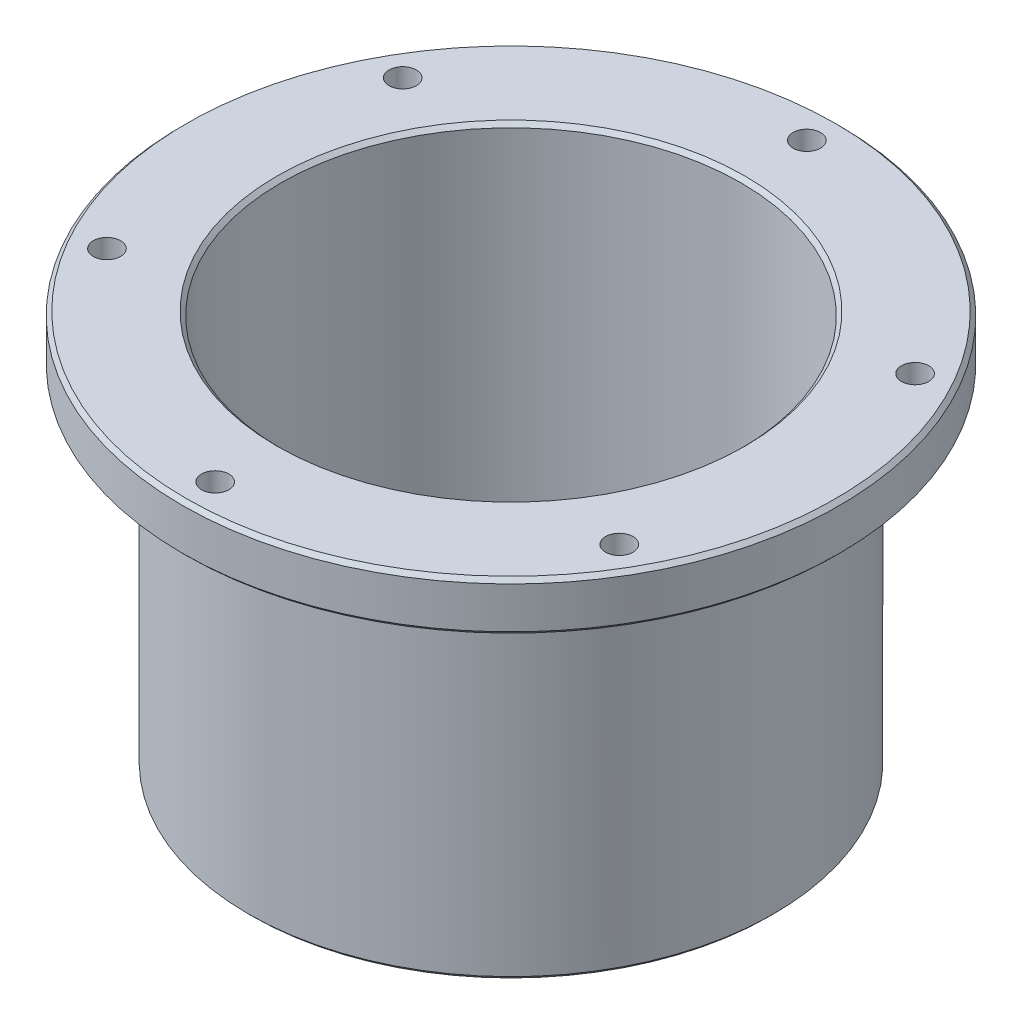
ISO-10303-21;
HEADER;
FILE_DESCRIPTION(('STEP AP214'),'2;1');
FILE_NAME('part.step','',(''),(''),'','','');
FILE_SCHEMA(('AUTOMOTIVE_DESIGN { 1 0 10303 214 1 1 1 1 }'));
ENDSEC;
DATA;
#1=APPLICATION_CONTEXT('core data for automotive mechanical design processes');
#2=APPLICATION_PROTOCOL_DEFINITION('international standard','automotive_design',2000,#1);
#3=PRODUCT_CONTEXT('',#1,'mechanical');
#4=PRODUCT('Part','Part','',(#3));
#5=PRODUCT_RELATED_PRODUCT_CATEGORY('part','',(#4));
#6=PRODUCT_DEFINITION_FORMATION('','',#4);
#7=PRODUCT_DEFINITION_CONTEXT('part definition',#1,'design');
#8=PRODUCT_DEFINITION('design','',#6,#7);
#9=PRODUCT_DEFINITION_SHAPE('','',#8);
#10=(LENGTH_UNIT() NAMED_UNIT(*) SI_UNIT(.MILLI.,.METRE.));
#11=(NAMED_UNIT(*) PLANE_ANGLE_UNIT() SI_UNIT($,.RADIAN.));
#12=(NAMED_UNIT(*) SI_UNIT($,.STERADIAN.) SOLID_ANGLE_UNIT());
#13=UNCERTAINTY_MEASURE_WITH_UNIT(LENGTH_MEASURE(1.E-05),#10,'distance_accuracy_value','');
#14=(GEOMETRIC_REPRESENTATION_CONTEXT(3) GLOBAL_UNCERTAINTY_ASSIGNED_CONTEXT((#13)) GLOBAL_UNIT_ASSIGNED_CONTEXT((#10,
#11,#12)) REPRESENTATION_CONTEXT('',''));
#15=CARTESIAN_POINT('',(0.,0.,0.));
#16=DIRECTION('',(0.,0.,1.));
#17=DIRECTION('',(1.,0.,0.));
#18=AXIS2_PLACEMENT_3D('',#15,#16,#17);
#19=CARTESIAN_POINT('',(-12.5758773367656,37.718999999829,0.));
#20=DIRECTION('',(0.,-1.,0.));
#21=DIRECTION('',(0.,0.,-1.));
#22=AXIS2_PLACEMENT_3D('',#19,#20,#21);
#23=CONICAL_SURFACE('',#22,31.749999999829,0.785398162500009);
#24=CARTESIAN_POINT('',(-12.5758773367656,37.719,0.));
#25=DIRECTION('',(0.,-1.,0.));
#26=DIRECTION('',(0.,0.,-1.));
#27=AXIS2_PLACEMENT_3D('',#24,#25,#26);
#28=CIRCLE('',#27,31.75);
#29=CARTESIAN_POINT('',(-12.5758773367656,37.719,-31.75));
#30=VERTEX_POINT('',#29);
#31=EDGE_CURVE('E71',#30,#30,#28,.T.);
#32=ORIENTED_EDGE('',*,*,#31,.F.);
#33=EDGE_LOOP('',(#32));
#34=FACE_BOUND('',#33,.T.);
#35=CARTESIAN_POINT('',(-12.5758773367656,38.100000000171,0.));
#36=DIRECTION('',(0.,-1.,0.));
#37=DIRECTION('',(0.,0.,-1.));
#38=AXIS2_PLACEMENT_3D('',#35,#36,#37);
#39=CIRCLE('',#38,31.369000000171);
#40=CARTESIAN_POINT('',(-12.5758773367656,38.100000000171,-31.369000000171));
#41=VERTEX_POINT('',#40);
#42=EDGE_CURVE('E18',#41,#41,#39,.F.);
#43=ORIENTED_EDGE('',*,*,#42,.F.);
#44=EDGE_LOOP('',(#43));
#45=FACE_BOUND('',#44,.T.);
#46=ADVANCED_FACE('F15',(#34,#45),#23,.T.);
#47=CARTESIAN_POINT('',(-12.5758773367656,38.100000000171,0.));
#48=DIRECTION('',(0.,1.,0.));
#49=DIRECTION('',(0.,0.,1.));
#50=AXIS2_PLACEMENT_3D('',#47,#48,#49);
#51=CONICAL_SURFACE('',#50,22.605999999829,0.7853981625);
#52=CARTESIAN_POINT('',(-12.5758773367656,38.100000000171,0.));
#53=DIRECTION('',(0.,1.,0.));
#54=DIRECTION('',(0.,0.,1.));
#55=AXIS2_PLACEMENT_3D('',#52,#53,#54);
#56=CIRCLE('',#55,22.605999999829);
#57=CARTESIAN_POINT('',(-12.5758773367656,38.100000000171,22.605999999829));
#58=VERTEX_POINT('',#57);
#59=EDGE_CURVE('E68',#58,#58,#56,.F.);
#60=ORIENTED_EDGE('',*,*,#59,.F.);
#61=EDGE_LOOP('',(#60));
#62=FACE_BOUND('',#61,.T.);
#63=CARTESIAN_POINT('',(-12.5758773367656,37.719,0.));
#64=DIRECTION('',(0.,-1.,0.));
#65=DIRECTION('',(0.,0.,-1.));
#66=AXIS2_PLACEMENT_3D('',#63,#64,#65);
#67=CIRCLE('',#66,22.225);
#68=CARTESIAN_POINT('',(-12.5758773367656,37.719,-22.225));
#69=VERTEX_POINT('',#68);
#70=EDGE_CURVE('E74',#69,#69,#67,.T.);
#71=ORIENTED_EDGE('',*,*,#70,.T.);
#72=EDGE_LOOP('',(#71));
#73=FACE_BOUND('',#72,.T.);
#74=ADVANCED_FACE('F133',(#62,#73),#51,.F.);
#75=CARTESIAN_POINT('',(-12.5758773367656,19.05,0.));
#76=DIRECTION('',(0.,-1.,0.));
#77=DIRECTION('',(0.,0.,-1.));
#78=AXIS2_PLACEMENT_3D('',#75,#76,#77);
#79=CYLINDRICAL_SURFACE('',#78,22.225);
#80=CARTESIAN_POINT('',(-12.5758773367656,0.381000000170963,0.));
#81=DIRECTION('',(0.,-1.,0.));
#82=DIRECTION('',(-1.,0.,0.));
#83=AXIS2_PLACEMENT_3D('',#80,#81,#82);
#84=CIRCLE('',#83,22.225000000171);
#85=CARTESIAN_POINT('',(-34.8008773369366,0.381000000170963,0.));
#86=VERTEX_POINT('',#85);
#87=EDGE_CURVE('E63',#86,#86,#84,.T.);
#88=ORIENTED_EDGE('',*,*,#87,.T.);
#89=EDGE_LOOP('',(#88));
#90=FACE_BOUND('',#89,.T.);
#91=ORIENTED_EDGE('',*,*,#70,.F.);
#92=EDGE_LOOP('',(#91));
#93=FACE_BOUND('',#92,.T.);
#94=ADVANCED_FACE('F139',(#90,#93),#79,.F.);
#95=CARTESIAN_POINT('',(-12.5758773367656,19.05,0.));
#96=DIRECTION('',(0.,-1.,0.));
#97=DIRECTION('',(0.,0.,-1.));
#98=AXIS2_PLACEMENT_3D('',#95,#96,#97);
#99=CYLINDRICAL_SURFACE('',#98,31.75);
#100=CARTESIAN_POINT('',(-12.5758773367656,33.718500000171,0.));
#101=DIRECTION('',(0.,1.,0.));
#102=DIRECTION('',(1.,0.,0.));
#103=AXIS2_PLACEMENT_3D('',#100,#101,#102);
#104=CIRCLE('',#103,31.749999999829);
#105=CARTESIAN_POINT('',(19.1741226630634,33.718500000171,0.));
#106=VERTEX_POINT('',#105);
#107=EDGE_CURVE('E54',#106,#106,#104,.F.);
#108=ORIENTED_EDGE('',*,*,#107,.F.);
#109=EDGE_LOOP('',(#108));
#110=FACE_BOUND('',#109,.T.);
#111=ORIENTED_EDGE('',*,*,#31,.T.);
#112=EDGE_LOOP('',(#111));
#113=FACE_BOUND('',#112,.T.);
#114=ADVANCED_FACE('F199',(#110,#113),#99,.T.);
#115=CARTESIAN_POINT('',(14.4116226632344,38.1,0.));
#116=DIRECTION('',(0.,1.,0.));
#117=DIRECTION('',(0.,0.,1.));
#118=AXIS2_PLACEMENT_3D('',#115,#116,#117);
#119=PLANE('',#118);
#120=ORIENTED_EDGE('',*,*,#59,.T.);
#121=EDGE_LOOP('',(#120));
#122=FACE_BOUND('',#121,.T.);
#123=CARTESIAN_POINT('',(-12.5758773367656,38.1,-28.575));
#124=DIRECTION('',(0.,1.,0.));
#125=DIRECTION('',(0.,0.,1.));
#126=AXIS2_PLACEMENT_3D('',#123,#124,#125);
#127=CIRCLE('',#126,1.3208);
#128=CARTESIAN_POINT('',(-12.5758773367656,38.1,-27.2542));
#129=VERTEX_POINT('',#128);
#130=EDGE_CURVE('E108',#129,#129,#127,.F.);
#131=ORIENTED_EDGE('',*,*,#130,.T.);
#132=EDGE_LOOP('',(#131));
#133=FACE_BOUND('',#132,.T.);
#134=CARTESIAN_POINT('',(12.1707985763747,38.1,-14.2875));
#135=DIRECTION('',(0.,1.,0.));
#136=DIRECTION('',(0.,0.,1.));
#137=AXIS2_PLACEMENT_3D('',#134,#135,#136);
#138=CIRCLE('',#137,1.3208);
#139=CARTESIAN_POINT('',(12.1707985763747,38.1,-12.9667));
#140=VERTEX_POINT('',#139);
#141=EDGE_CURVE('E111',#140,#140,#138,.F.);
#142=ORIENTED_EDGE('',*,*,#141,.T.);
#143=EDGE_LOOP('',(#142));
#144=FACE_BOUND('',#143,.T.);
#145=CARTESIAN_POINT('',(12.1707985763747,38.1,14.2875));
#146=DIRECTION('',(0.,1.,0.));
#147=DIRECTION('',(0.,0.,1.));
#148=AXIS2_PLACEMENT_3D('',#145,#146,#147);
#149=CIRCLE('',#148,1.3208);
#150=CARTESIAN_POINT('',(12.1707985763747,38.1,15.6083));
#151=VERTEX_POINT('',#150);
#152=EDGE_CURVE('E114',#151,#151,#149,.F.);
#153=ORIENTED_EDGE('',*,*,#152,.T.);
#154=EDGE_LOOP('',(#153));
#155=FACE_BOUND('',#154,.T.);
#156=CARTESIAN_POINT('',(-12.5758773367656,38.1,28.575));
#157=DIRECTION('',(0.,1.,0.));
#158=DIRECTION('',(0.,0.,1.));
#159=AXIS2_PLACEMENT_3D('',#156,#157,#158);
#160=CIRCLE('',#159,1.3208);
#161=CARTESIAN_POINT('',(-12.5758773367656,38.1,29.8958));
#162=VERTEX_POINT('',#161);
#163=EDGE_CURVE('E117',#162,#162,#160,.F.);
#164=ORIENTED_EDGE('',*,*,#163,.T.);
#165=EDGE_LOOP('',(#164));
#166=FACE_BOUND('',#165,.T.);
#167=CARTESIAN_POINT('',(-37.3225532499059,38.1,14.2875));
#168=DIRECTION('',(0.,1.,0.));
#169=DIRECTION('',(0.,0.,1.));
#170=AXIS2_PLACEMENT_3D('',#167,#168,#169);
#171=CIRCLE('',#170,1.3208);
#172=CARTESIAN_POINT('',(-37.3225532499059,38.1,15.6083));
#173=VERTEX_POINT('',#172);
#174=EDGE_CURVE('E120',#173,#173,#171,.F.);
#175=ORIENTED_EDGE('',*,*,#174,.T.);
#176=EDGE_LOOP('',(#175));
#177=FACE_BOUND('',#176,.T.);
#178=CARTESIAN_POINT('',(-37.3225532499059,38.1,-14.2875));
#179=DIRECTION('',(0.,1.,0.));
#180=DIRECTION('',(0.,0.,1.));
#181=AXIS2_PLACEMENT_3D('',#178,#179,#180);
#182=CIRCLE('',#181,1.3208);
#183=CARTESIAN_POINT('',(-37.3225532499059,38.1,-12.9667));
#184=VERTEX_POINT('',#183);
#185=EDGE_CURVE('E62',#184,#184,#182,.F.);
#186=ORIENTED_EDGE('',*,*,#185,.T.);
#187=EDGE_LOOP('',(#186));
#188=FACE_BOUND('',#187,.T.);
#189=ORIENTED_EDGE('',*,*,#42,.T.);
#190=EDGE_LOOP('',(#189));
#191=FACE_BOUND('',#190,.T.);
#192=ADVANCED_FACE('F130',(#122,#133,#144,#155,#166,#177,#188,#191),#119,.T.);
#193=CARTESIAN_POINT('',(-12.5758773367656,-1.70969521092607E-10,0.));
#194=DIRECTION('',(0.,-1.,0.));
#195=DIRECTION('',(0.,0.,-1.));
#196=AXIS2_PLACEMENT_3D('',#193,#194,#195);
#197=CONICAL_SURFACE('',#196,22.605999999829,0.785398162500001);
#198=ORIENTED_EDGE('',*,*,#87,.F.);
#199=EDGE_LOOP('',(#198));
#200=FACE_BOUND('',#199,.T.);
#201=CARTESIAN_POINT('',(-12.5758773367656,-1.70966973217501E-10,0.));
#202=DIRECTION('',(0.,-1.,0.));
#203=DIRECTION('',(0.,0.,-1.));
#204=AXIS2_PLACEMENT_3D('',#201,#202,#203);
#205=CIRCLE('',#204,22.605999999829);
#206=CARTESIAN_POINT('',(-12.5758773367656,-1.70966973217501E-10,-22.605999999829));
#207=VERTEX_POINT('',#206);
#208=EDGE_CURVE('E105',#207,#207,#205,.F.);
#209=ORIENTED_EDGE('',*,*,#208,.F.);
#210=EDGE_LOOP('',(#209));
#211=FACE_BOUND('',#210,.T.);
#212=ADVANCED_FACE('F192',(#200,#211),#197,.F.);
#213=CARTESIAN_POINT('',(-12.5758773367656,33.718500000171,0.));
#214=DIRECTION('',(0.,1.,0.));
#215=DIRECTION('',(0.,0.,1.));
#216=AXIS2_PLACEMENT_3D('',#213,#214,#215);
#217=CONICAL_SURFACE('',#216,31.749999999829,0.785398162499991);
#218=ORIENTED_EDGE('',*,*,#107,.T.);
#219=EDGE_LOOP('',(#218));
#220=FACE_BOUND('',#219,.T.);
#221=CARTESIAN_POINT('',(-12.5758773367656,33.337499999829,0.));
#222=DIRECTION('',(0.,1.,0.));
#223=DIRECTION('',(0.,0.,1.));
#224=AXIS2_PLACEMENT_3D('',#221,#222,#223);
#225=CIRCLE('',#224,31.369000000171);
#226=CARTESIAN_POINT('',(-12.5758773367656,33.337499999829,31.369000000171));
#227=VERTEX_POINT('',#226);
#228=EDGE_CURVE('E102',#227,#227,#225,.T.);
#229=ORIENTED_EDGE('',*,*,#228,.T.);
#230=EDGE_LOOP('',(#229));
#231=FACE_BOUND('',#230,.T.);
#232=ADVANCED_FACE('F188',(#220,#231),#217,.T.);
#233=CARTESIAN_POINT('',(-37.3225532499059,-59.4505509979313,-14.2875));
#234=DIRECTION('',(0.,1.,0.));
#235=DIRECTION('',(0.,0.,1.));
#236=AXIS2_PLACEMENT_3D('',#233,#234,#235);
#237=CYLINDRICAL_SURFACE('',#236,1.3208);
#238=ORIENTED_EDGE('',*,*,#185,.F.);
#239=EDGE_LOOP('',(#238));
#240=FACE_BOUND('',#239,.T.);
#241=CARTESIAN_POINT('',(-37.3225532499059,33.3375,-14.2875));
#242=DIRECTION('',(0.,1.,0.));
#243=DIRECTION('',(0.,0.,1.));
#244=AXIS2_PLACEMENT_3D('',#241,#242,#243);
#245=CIRCLE('',#244,1.3208);
#246=CARTESIAN_POINT('',(-37.3225532499059,33.3375,-12.9667));
#247=VERTEX_POINT('',#246);
#248=EDGE_CURVE('E99',#247,#247,#245,.F.);
#249=ORIENTED_EDGE('',*,*,#248,.T.);
#250=EDGE_LOOP('',(#249));
#251=FACE_BOUND('',#250,.T.);
#252=ADVANCED_FACE('F184',(#240,#251),#237,.F.);
#253=CARTESIAN_POINT('',(-37.3225532499059,-59.4505509979313,14.2875));
#254=DIRECTION('',(0.,1.,0.));
#255=DIRECTION('',(0.,0.,1.));
#256=AXIS2_PLACEMENT_3D('',#253,#254,#255);
#257=CYLINDRICAL_SURFACE('',#256,1.3208);
#258=ORIENTED_EDGE('',*,*,#174,.F.);
#259=EDGE_LOOP('',(#258));
#260=FACE_BOUND('',#259,.T.);
#261=CARTESIAN_POINT('',(-37.3225532499059,33.3375,14.2875));
#262=DIRECTION('',(0.,1.,0.));
#263=DIRECTION('',(0.,0.,1.));
#264=AXIS2_PLACEMENT_3D('',#261,#262,#263);
#265=CIRCLE('',#264,1.3208);
#266=CARTESIAN_POINT('',(-37.3225532499059,33.3375,15.6083));
#267=VERTEX_POINT('',#266);
#268=EDGE_CURVE('E96',#267,#267,#265,.F.);
#269=ORIENTED_EDGE('',*,*,#268,.T.);
#270=EDGE_LOOP('',(#269));
#271=FACE_BOUND('',#270,.T.);
#272=ADVANCED_FACE('F180',(#260,#271),#257,.F.);
#273=CARTESIAN_POINT('',(-12.5758773367656,-59.4505509979313,28.575));
#274=DIRECTION('',(0.,1.,0.));
#275=DIRECTION('',(0.,0.,1.));
#276=AXIS2_PLACEMENT_3D('',#273,#274,#275);
#277=CYLINDRICAL_SURFACE('',#276,1.3208);
#278=ORIENTED_EDGE('',*,*,#163,.F.);
#279=EDGE_LOOP('',(#278));
#280=FACE_BOUND('',#279,.T.);
#281=CARTESIAN_POINT('',(-12.5758773367656,33.3375,28.575));
#282=DIRECTION('',(0.,1.,0.));
#283=DIRECTION('',(0.,0.,1.));
#284=AXIS2_PLACEMENT_3D('',#281,#282,#283);
#285=CIRCLE('',#284,1.3208);
#286=CARTESIAN_POINT('',(-12.5758773367656,33.3375,29.8958));
#287=VERTEX_POINT('',#286);
#288=EDGE_CURVE('E93',#287,#287,#285,.F.);
#289=ORIENTED_EDGE('',*,*,#288,.T.);
#290=EDGE_LOOP('',(#289));
#291=FACE_BOUND('',#290,.T.);
#292=ADVANCED_FACE('F176',(#280,#291),#277,.F.);
#293=CARTESIAN_POINT('',(12.1707985763747,-59.4505509979313,14.2875));
#294=DIRECTION('',(0.,1.,0.));
#295=DIRECTION('',(0.,0.,1.));
#296=AXIS2_PLACEMENT_3D('',#293,#294,#295);
#297=CYLINDRICAL_SURFACE('',#296,1.3208);
#298=ORIENTED_EDGE('',*,*,#152,.F.);
#299=EDGE_LOOP('',(#298));
#300=FACE_BOUND('',#299,.T.);
#301=CARTESIAN_POINT('',(12.1707985763747,33.3375,14.2875));
#302=DIRECTION('',(0.,1.,0.));
#303=DIRECTION('',(0.,0.,1.));
#304=AXIS2_PLACEMENT_3D('',#301,#302,#303);
#305=CIRCLE('',#304,1.3208);
#306=CARTESIAN_POINT('',(12.1707985763747,33.3375,15.6083));
#307=VERTEX_POINT('',#306);
#308=EDGE_CURVE('E90',#307,#307,#305,.F.);
#309=ORIENTED_EDGE('',*,*,#308,.T.);
#310=EDGE_LOOP('',(#309));
#311=FACE_BOUND('',#310,.T.);
#312=ADVANCED_FACE('F172',(#300,#311),#297,.F.);
#313=CARTESIAN_POINT('',(12.1707985763747,-59.4505509979313,-14.2875));
#314=DIRECTION('',(0.,1.,0.));
#315=DIRECTION('',(0.,0.,1.));
#316=AXIS2_PLACEMENT_3D('',#313,#314,#315);
#317=CYLINDRICAL_SURFACE('',#316,1.3208);
#318=ORIENTED_EDGE('',*,*,#141,.F.);
#319=EDGE_LOOP('',(#318));
#320=FACE_BOUND('',#319,.T.);
#321=CARTESIAN_POINT('',(12.1707985763747,33.3375,-14.2875));
#322=DIRECTION('',(0.,1.,0.));
#323=DIRECTION('',(0.,0.,1.));
#324=AXIS2_PLACEMENT_3D('',#321,#322,#323);
#325=CIRCLE('',#324,1.3208);
#326=CARTESIAN_POINT('',(12.1707985763747,33.3375,-12.9667));
#327=VERTEX_POINT('',#326);
#328=EDGE_CURVE('E87',#327,#327,#325,.F.);
#329=ORIENTED_EDGE('',*,*,#328,.T.);
#330=EDGE_LOOP('',(#329));
#331=FACE_BOUND('',#330,.T.);
#332=ADVANCED_FACE('F165',(#320,#331),#317,.F.);
#333=CARTESIAN_POINT('',(-12.5758773367656,-59.4505509979313,-28.575));
#334=DIRECTION('',(0.,1.,0.));
#335=DIRECTION('',(0.,0.,1.));
#336=AXIS2_PLACEMENT_3D('',#333,#334,#335);
#337=CYLINDRICAL_SURFACE('',#336,1.3208);
#338=ORIENTED_EDGE('',*,*,#130,.F.);
#339=EDGE_LOOP('',(#338));
#340=FACE_BOUND('',#339,.T.);
#341=CARTESIAN_POINT('',(-12.5758773367656,33.3375,-28.575));
#342=DIRECTION('',(0.,1.,0.));
#343=DIRECTION('',(0.,0.,1.));
#344=AXIS2_PLACEMENT_3D('',#341,#342,#343);
#345=CIRCLE('',#344,1.3208);
#346=CARTESIAN_POINT('',(-12.5758773367656,33.3375,-27.2542));
#347=VERTEX_POINT('',#346);
#348=EDGE_CURVE('E84',#347,#347,#345,.F.);
#349=ORIENTED_EDGE('',*,*,#348,.T.);
#350=EDGE_LOOP('',(#349));
#351=FACE_BOUND('',#350,.T.);
#352=ADVANCED_FACE('F159',(#340,#351),#337,.F.);
#353=CARTESIAN_POINT('',(14.4116226632344,0.,0.));
#354=DIRECTION('',(0.,-1.,0.));
#355=DIRECTION('',(0.,0.,-1.));
#356=AXIS2_PLACEMENT_3D('',#353,#354,#355);
#357=PLANE('',#356);
#358=ORIENTED_EDGE('',*,*,#208,.T.);
#359=EDGE_LOOP('',(#358));
#360=FACE_BOUND('',#359,.T.);
#361=CARTESIAN_POINT('',(-12.5758773367656,-1.70965346914242E-10,0.));
#362=DIRECTION('',(0.,1.,0.));
#363=DIRECTION('',(0.,0.,1.));
#364=AXIS2_PLACEMENT_3D('',#361,#362,#363);
#365=CIRCLE('',#364,25.019000000171);
#366=CARTESIAN_POINT('',(-12.5758773367656,-1.70965346914242E-10,25.019000000171));
#367=VERTEX_POINT('',#366);
#368=EDGE_CURVE('E81',#367,#367,#365,.T.);
#369=ORIENTED_EDGE('',*,*,#368,.F.);
#370=EDGE_LOOP('',(#369));
#371=FACE_BOUND('',#370,.T.);
#372=ADVANCED_FACE('F154',(#360,#371),#357,.T.);
#373=CARTESIAN_POINT('',(-12.5758773367656,33.3375,0.));
#374=DIRECTION('',(0.,1.,0.));
#375=DIRECTION('',(0.,0.,1.));
#376=AXIS2_PLACEMENT_3D('',#373,#374,#375);
#377=PLANE('',#376);
#378=CARTESIAN_POINT('',(-12.5758773367656,33.3375,0.));
#379=DIRECTION('',(0.,-1.,0.));
#380=DIRECTION('',(1.,0.,0.));
#381=AXIS2_PLACEMENT_3D('',#378,#379,#380);
#382=CIRCLE('',#381,25.654);
#383=CARTESIAN_POINT('',(13.0781226632344,33.3375,0.));
#384=VERTEX_POINT('',#383);
#385=EDGE_CURVE('E27',#384,#384,#382,.F.);
#386=ORIENTED_EDGE('',*,*,#385,.T.);
#387=EDGE_LOOP('',(#386));
#388=FACE_BOUND('',#387,.T.);
#389=ORIENTED_EDGE('',*,*,#348,.F.);
#390=EDGE_LOOP('',(#389));
#391=FACE_BOUND('',#390,.T.);
#392=ORIENTED_EDGE('',*,*,#328,.F.);
#393=EDGE_LOOP('',(#392));
#394=FACE_BOUND('',#393,.T.);
#395=ORIENTED_EDGE('',*,*,#308,.F.);
#396=EDGE_LOOP('',(#395));
#397=FACE_BOUND('',#396,.T.);
#398=ORIENTED_EDGE('',*,*,#288,.F.);
#399=EDGE_LOOP('',(#398));
#400=FACE_BOUND('',#399,.T.);
#401=ORIENTED_EDGE('',*,*,#268,.F.);
#402=EDGE_LOOP('',(#401));
#403=FACE_BOUND('',#402,.T.);
#404=ORIENTED_EDGE('',*,*,#248,.F.);
#405=EDGE_LOOP('',(#404));
#406=FACE_BOUND('',#405,.T.);
#407=ORIENTED_EDGE('',*,*,#228,.F.);
#408=EDGE_LOOP('',(#407));
#409=FACE_BOUND('',#408,.T.);
#410=ADVANCED_FACE('F149',(#388,#391,#394,#397,#400,#403,#406,#409),#377,.F.);
#411=CARTESIAN_POINT('',(-12.5758773367656,0.381000000170963,0.));
#412=DIRECTION('',(0.,1.,0.));
#413=DIRECTION('',(0.,0.,1.));
#414=AXIS2_PLACEMENT_3D('',#411,#412,#413);
#415=CONICAL_SURFACE('',#414,25.399999999829,0.7853981625);
#416=ORIENTED_EDGE('',*,*,#368,.T.);
#417=EDGE_LOOP('',(#416));
#418=FACE_BOUND('',#417,.T.);
#419=CARTESIAN_POINT('',(-12.5758773367656,0.381,0.));
#420=DIRECTION('',(0.,1.,0.));
#421=DIRECTION('',(0.,0.,1.));
#422=AXIS2_PLACEMENT_3D('',#419,#420,#421);
#423=CIRCLE('',#422,25.4);
#424=CARTESIAN_POINT('',(-12.5758773367656,0.381,25.4));
#425=VERTEX_POINT('',#424);
#426=EDGE_CURVE('E22',#425,#425,#423,.T.);
#427=ORIENTED_EDGE('',*,*,#426,.F.);
#428=EDGE_LOOP('',(#427));
#429=FACE_BOUND('',#428,.T.);
#430=ADVANCED_FACE('F45',(#418,#429),#415,.T.);
#431=CARTESIAN_POINT('',(-12.5758773367656,33.0835,0.));
#432=DIRECTION('',(0.,-1.,0.));
#433=DIRECTION('',(0.,0.,-1.));
#434=AXIS2_PLACEMENT_3D('',#431,#432,#433);
#435=TOROIDAL_SURFACE('',#434,25.654,0.254);
#436=CARTESIAN_POINT('',(-12.5758773367656,33.0835,0.));
#437=DIRECTION('',(0.,1.,0.));
#438=DIRECTION('',(0.,0.,1.));
#439=AXIS2_PLACEMENT_3D('',#436,#437,#438);
#440=CIRCLE('',#439,25.4);
#441=CARTESIAN_POINT('',(-12.5758773367656,33.0835,25.4));
#442=VERTEX_POINT('',#441);
#443=EDGE_CURVE('E10',#442,#442,#440,.F.);
#444=ORIENTED_EDGE('',*,*,#443,.F.);
#445=EDGE_LOOP('',(#444));
#446=FACE_BOUND('',#445,.T.);
#447=ORIENTED_EDGE('',*,*,#385,.F.);
#448=EDGE_LOOP('',(#447));
#449=FACE_BOUND('',#448,.T.);
#450=ADVANCED_FACE('F39',(#446,#449),#435,.F.);
#451=CARTESIAN_POINT('',(-12.5758773367656,0.,0.));
#452=DIRECTION('',(0.,1.,0.));
#453=DIRECTION('',(0.,0.,1.));
#454=AXIS2_PLACEMENT_3D('',#451,#452,#453);
#455=CYLINDRICAL_SURFACE('',#454,25.4);
#456=ORIENTED_EDGE('',*,*,#443,.T.);
#457=EDGE_LOOP('',(#456));
#458=FACE_BOUND('',#457,.T.);
#459=ORIENTED_EDGE('',*,*,#426,.T.);
#460=EDGE_LOOP('',(#459));
#461=FACE_BOUND('',#460,.T.);
#462=ADVANCED_FACE('F44',(#458,#461),#455,.T.);
#463=CLOSED_SHELL('',(#46,#74,#94,#114,#192,#212,#232,#252,#272,#292,#312,#332,#352,#372,#410,
#430,#450,#462));
#464=MANIFOLD_SOLID_BREP('B1',#463);
#465=ADVANCED_BREP_SHAPE_REPRESENTATION('',(#18,#464),#14);
#466=SHAPE_DEFINITION_REPRESENTATION(#9,#465);
ENDSEC;
END-ISO-10303-21;
